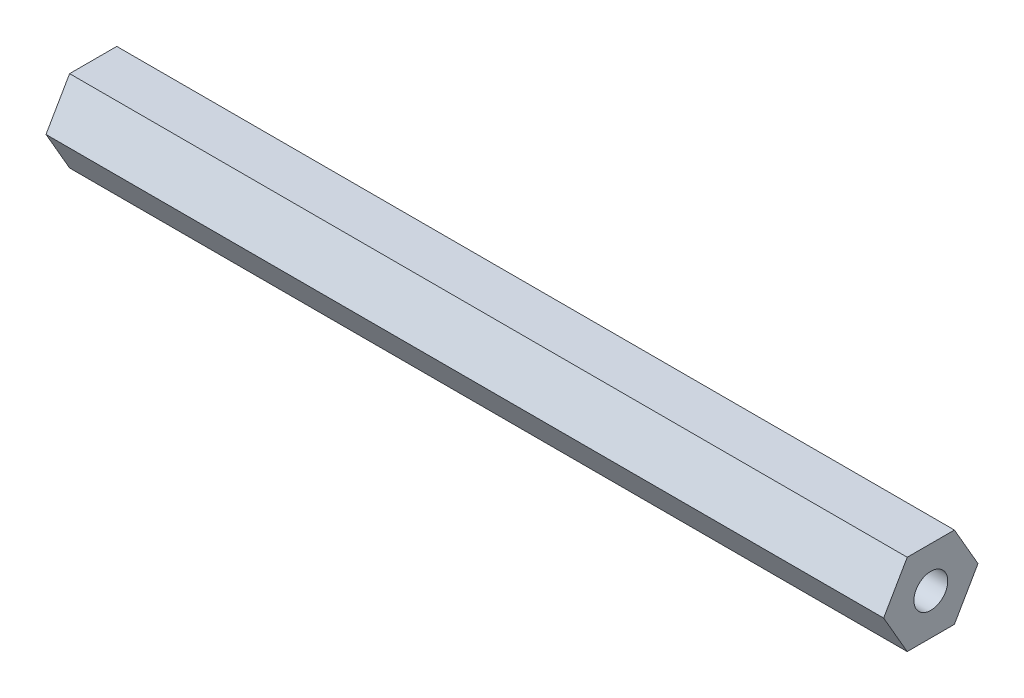
ISO-10303-21;
HEADER;
FILE_DESCRIPTION(('STEP AP214'),'2;1');
FILE_NAME('part.step','',(''),(''),'','','');
FILE_SCHEMA(('AUTOMOTIVE_DESIGN { 1 0 10303 214 1 1 1 1 }'));
ENDSEC;
DATA;
#1=APPLICATION_CONTEXT('core data for automotive mechanical design processes');
#2=APPLICATION_PROTOCOL_DEFINITION('international standard','automotive_design',2000,#1);
#3=PRODUCT_CONTEXT('',#1,'mechanical');
#4=PRODUCT('Part','Part','',(#3));
#5=PRODUCT_RELATED_PRODUCT_CATEGORY('part','',(#4));
#6=PRODUCT_DEFINITION_FORMATION('','',#4);
#7=PRODUCT_DEFINITION_CONTEXT('part definition',#1,'design');
#8=PRODUCT_DEFINITION('design','',#6,#7);
#9=PRODUCT_DEFINITION_SHAPE('','',#8);
#10=(LENGTH_UNIT() NAMED_UNIT(*) SI_UNIT(.MILLI.,.METRE.));
#11=(NAMED_UNIT(*) PLANE_ANGLE_UNIT() SI_UNIT($,.RADIAN.));
#12=(NAMED_UNIT(*) SI_UNIT($,.STERADIAN.) SOLID_ANGLE_UNIT());
#13=UNCERTAINTY_MEASURE_WITH_UNIT(LENGTH_MEASURE(1.E-05),#10,'distance_accuracy_value','');
#14=(GEOMETRIC_REPRESENTATION_CONTEXT(3) GLOBAL_UNCERTAINTY_ASSIGNED_CONTEXT((#13)) GLOBAL_UNIT_ASSIGNED_CONTEXT((#10,
#11,#12)) REPRESENTATION_CONTEXT('',''));
#15=CARTESIAN_POINT('',(0.,0.,0.));
#16=DIRECTION('',(0.,0.,1.));
#17=DIRECTION('',(1.,0.,0.));
#18=AXIS2_PLACEMENT_3D('',#15,#16,#17);
#19=CARTESIAN_POINT('',(130.175,0.,0.));
#20=DIRECTION('',(1.,0.,0.));
#21=DIRECTION('',(0.,0.,-1.));
#22=AXIS2_PLACEMENT_3D('',#19,#20,#21);
#23=PLANE('',#22);
#24=DIRECTION('',(0.,0.866025403784438,0.5));
#25=VECTOR('',#24,1.);
#26=CARTESIAN_POINT('',(130.175,0.,-7.33234841870825));
#27=LINE('',#26,#25);
#28=CARTESIAN_POINT('',(130.175,0.,-7.33234841870825));
#29=VERTEX_POINT('',#28);
#30=CARTESIAN_POINT('',(130.175,6.35,-3.66617420935412));
#31=VERTEX_POINT('',#30);
#32=EDGE_CURVE('E129',#29,#31,#27,.T.);
#33=ORIENTED_EDGE('',*,*,#32,.T.);
#34=DIRECTION('',(0.,0.,1.));
#35=VECTOR('',#34,1.);
#36=CARTESIAN_POINT('',(130.175,6.35,-3.66617420935412));
#37=LINE('',#36,#35);
#38=CARTESIAN_POINT('',(130.175,6.35,3.66617420935412));
#39=VERTEX_POINT('',#38);
#40=EDGE_CURVE('E87',#31,#39,#37,.T.);
#41=ORIENTED_EDGE('',*,*,#40,.T.);
#42=DIRECTION('',(0.,-0.866025403784439,0.5));
#43=VECTOR('',#42,1.);
#44=CARTESIAN_POINT('',(130.175,6.35,3.66617420935412));
#45=LINE('',#44,#43);
#46=CARTESIAN_POINT('',(130.175,0.,7.33234841870825));
#47=VERTEX_POINT('',#46);
#48=EDGE_CURVE('E100',#39,#47,#45,.T.);
#49=ORIENTED_EDGE('',*,*,#48,.T.);
#50=DIRECTION('',(0.,-0.866025403784438,-0.5));
#51=VECTOR('',#50,1.);
#52=CARTESIAN_POINT('',(130.175,0.,7.33234841870825));
#53=LINE('',#52,#51);
#54=CARTESIAN_POINT('',(130.175,-6.35,3.66617420935412));
#55=VERTEX_POINT('',#54);
#56=EDGE_CURVE('E94',#47,#55,#53,.T.);
#57=ORIENTED_EDGE('',*,*,#56,.T.);
#58=DIRECTION('',(0.,0.,-1.));
#59=VECTOR('',#58,1.);
#60=CARTESIAN_POINT('',(130.175,-6.35,3.66617420935412));
#61=LINE('',#60,#59);
#62=CARTESIAN_POINT('',(130.175,-6.35,-3.66617420935413));
#63=VERTEX_POINT('',#62);
#64=EDGE_CURVE('E98',#55,#63,#61,.T.);
#65=ORIENTED_EDGE('',*,*,#64,.T.);
#66=DIRECTION('',(0.,0.866025403784439,-0.5));
#67=VECTOR('',#66,1.);
#68=CARTESIAN_POINT('',(130.175,-6.35,-3.66617420935413));
#69=LINE('',#68,#67);
#70=EDGE_CURVE('E50',#63,#29,#69,.T.);
#71=ORIENTED_EDGE('',*,*,#70,.T.);
#72=EDGE_LOOP('',(#33,#41,#49,#57,#65,#71));
#73=FACE_BOUND('',#72,.T.);
#74=CARTESIAN_POINT('',(130.175,0.,0.));
#75=DIRECTION('',(1.,0.,0.));
#76=DIRECTION('',(0.,0.,-1.));
#77=AXIS2_PLACEMENT_3D('',#74,#75,#76);
#78=CIRCLE('',#77,2.6289);
#79=CARTESIAN_POINT('',(130.175,0.,-2.6289));
#80=VERTEX_POINT('',#79);
#81=EDGE_CURVE('E122',#80,#80,#78,.T.);
#82=ORIENTED_EDGE('',*,*,#81,.F.);
#83=EDGE_LOOP('',(#82));
#84=FACE_BOUND('',#83,.T.);
#85=ADVANCED_FACE('F33',(#73,#84),#23,.T.);
#86=CARTESIAN_POINT('',(0.,0.,0.));
#87=DIRECTION('',(1.,0.,0.));
#88=DIRECTION('',(0.,0.,-1.));
#89=AXIS2_PLACEMENT_3D('',#86,#87,#88);
#90=PLANE('',#89);
#91=DIRECTION('',(0.,0.866025403784438,0.5));
#92=VECTOR('',#91,1.);
#93=CARTESIAN_POINT('',(0.,0.,-7.33234841870825));
#94=LINE('',#93,#92);
#95=CARTESIAN_POINT('',(0.,0.,-7.33234841870825));
#96=VERTEX_POINT('',#95);
#97=CARTESIAN_POINT('',(0.,6.35,-3.66617420935412));
#98=VERTEX_POINT('',#97);
#99=EDGE_CURVE('E118',#96,#98,#94,.T.);
#100=ORIENTED_EDGE('',*,*,#99,.F.);
#101=DIRECTION('',(0.,0.866025403784439,-0.5));
#102=VECTOR('',#101,1.);
#103=CARTESIAN_POINT('',(0.,-6.35,-3.66617420935413));
#104=LINE('',#103,#102);
#105=CARTESIAN_POINT('',(0.,-6.35,-3.66617420935413));
#106=VERTEX_POINT('',#105);
#107=EDGE_CURVE('E79',#106,#96,#104,.T.);
#108=ORIENTED_EDGE('',*,*,#107,.F.);
#109=DIRECTION('',(0.,0.,-1.));
#110=VECTOR('',#109,1.);
#111=CARTESIAN_POINT('',(0.,-6.35,3.66617420935412));
#112=LINE('',#111,#110);
#113=CARTESIAN_POINT('',(0.,-6.35,3.66617420935412));
#114=VERTEX_POINT('',#113);
#115=EDGE_CURVE('E73',#114,#106,#112,.T.);
#116=ORIENTED_EDGE('',*,*,#115,.F.);
#117=DIRECTION('',(0.,-0.866025403784438,-0.5));
#118=VECTOR('',#117,1.);
#119=CARTESIAN_POINT('',(0.,0.,7.33234841870825));
#120=LINE('',#119,#118);
#121=CARTESIAN_POINT('',(0.,0.,7.33234841870825));
#122=VERTEX_POINT('',#121);
#123=EDGE_CURVE('E108',#122,#114,#120,.T.);
#124=ORIENTED_EDGE('',*,*,#123,.F.);
#125=DIRECTION('',(0.,-0.866025403784439,0.5));
#126=VECTOR('',#125,1.);
#127=CARTESIAN_POINT('',(0.,6.35,3.66617420935412));
#128=LINE('',#127,#126);
#129=CARTESIAN_POINT('',(0.,6.35,3.66617420935412));
#130=VERTEX_POINT('',#129);
#131=EDGE_CURVE('E124',#130,#122,#128,.T.);
#132=ORIENTED_EDGE('',*,*,#131,.F.);
#133=DIRECTION('',(0.,0.,1.));
#134=VECTOR('',#133,1.);
#135=CARTESIAN_POINT('',(0.,6.35,-3.66617420935412));
#136=LINE('',#135,#134);
#137=EDGE_CURVE('E121',#98,#130,#136,.T.);
#138=ORIENTED_EDGE('',*,*,#137,.F.);
#139=EDGE_LOOP('',(#100,#108,#116,#124,#132,#138));
#140=FACE_BOUND('',#139,.T.);
#141=CARTESIAN_POINT('',(0.,0.,0.));
#142=DIRECTION('',(1.,0.,0.));
#143=DIRECTION('',(0.,0.,-1.));
#144=AXIS2_PLACEMENT_3D('',#141,#142,#143);
#145=CIRCLE('',#144,2.6289);
#146=CARTESIAN_POINT('',(0.,0.,-2.6289));
#147=VERTEX_POINT('',#146);
#148=EDGE_CURVE('E222',#147,#147,#145,.T.);
#149=ORIENTED_EDGE('',*,*,#148,.T.);
#150=EDGE_LOOP('',(#149));
#151=FACE_BOUND('',#150,.T.);
#152=ADVANCED_FACE('F138',(#140,#151),#90,.F.);
#153=CARTESIAN_POINT('',(130.175,0.,-7.33234841870825));
#154=DIRECTION('',(0.,-0.5,0.866025403784438));
#155=DIRECTION('',(0.,-0.866025403784438,-0.5));
#156=AXIS2_PLACEMENT_3D('',#153,#154,#155);
#157=PLANE('',#156);
#158=ORIENTED_EDGE('',*,*,#99,.T.);
#159=DIRECTION('',(-1.,0.,0.));
#160=VECTOR('',#159,1.);
#161=CARTESIAN_POINT('',(130.175,6.35,-3.66617420935412));
#162=LINE('',#161,#160);
#163=EDGE_CURVE('E11',#31,#98,#162,.T.);
#164=ORIENTED_EDGE('',*,*,#163,.F.);
#165=ORIENTED_EDGE('',*,*,#32,.F.);
#166=DIRECTION('',(-1.,0.,0.));
#167=VECTOR('',#166,1.);
#168=CARTESIAN_POINT('',(130.175,0.,-7.33234841870825));
#169=LINE('',#168,#167);
#170=EDGE_CURVE('E114',#29,#96,#169,.T.);
#171=ORIENTED_EDGE('',*,*,#170,.T.);
#172=EDGE_LOOP('',(#158,#164,#165,#171));
#173=FACE_BOUND('',#172,.T.);
#174=ADVANCED_FACE('F35',(#173),#157,.F.);
#175=CARTESIAN_POINT('',(130.175,6.35,-3.66617420935412));
#176=DIRECTION('',(0.,-1.,0.));
#177=DIRECTION('',(0.,0.,-1.));
#178=AXIS2_PLACEMENT_3D('',#175,#176,#177);
#179=PLANE('',#178);
#180=ORIENTED_EDGE('',*,*,#137,.T.);
#181=DIRECTION('',(-1.,0.,0.));
#182=VECTOR('',#181,1.);
#183=CARTESIAN_POINT('',(130.175,6.35,3.66617420935412));
#184=LINE('',#183,#182);
#185=EDGE_CURVE('E42',#39,#130,#184,.T.);
#186=ORIENTED_EDGE('',*,*,#185,.F.);
#187=ORIENTED_EDGE('',*,*,#40,.F.);
#188=ORIENTED_EDGE('',*,*,#163,.T.);
#189=EDGE_LOOP('',(#180,#186,#187,#188));
#190=FACE_BOUND('',#189,.T.);
#191=ADVANCED_FACE('F163',(#190),#179,.F.);
#192=CARTESIAN_POINT('',(130.175,6.35,3.66617420935412));
#193=DIRECTION('',(0.,-0.5,-0.866025403784439));
#194=DIRECTION('',(0.,0.866025403784439,-0.5));
#195=AXIS2_PLACEMENT_3D('',#192,#193,#194);
#196=PLANE('',#195);
#197=ORIENTED_EDGE('',*,*,#131,.T.);
#198=DIRECTION('',(-1.,0.,0.));
#199=VECTOR('',#198,1.);
#200=CARTESIAN_POINT('',(130.175,0.,7.33234841870825));
#201=LINE('',#200,#199);
#202=EDGE_CURVE('E109',#47,#122,#201,.T.);
#203=ORIENTED_EDGE('',*,*,#202,.F.);
#204=ORIENTED_EDGE('',*,*,#48,.F.);
#205=ORIENTED_EDGE('',*,*,#185,.T.);
#206=EDGE_LOOP('',(#197,#203,#204,#205));
#207=FACE_BOUND('',#206,.T.);
#208=ADVANCED_FACE('F135',(#207),#196,.F.);
#209=CARTESIAN_POINT('',(130.175,0.,7.33234841870825));
#210=DIRECTION('',(0.,0.5,-0.866025403784438));
#211=DIRECTION('',(0.,0.866025403784439,0.5));
#212=AXIS2_PLACEMENT_3D('',#209,#210,#211);
#213=PLANE('',#212);
#214=ORIENTED_EDGE('',*,*,#123,.T.);
#215=DIRECTION('',(-1.,0.,0.));
#216=VECTOR('',#215,1.);
#217=CARTESIAN_POINT('',(130.175,-6.35,3.66617420935412));
#218=LINE('',#217,#216);
#219=EDGE_CURVE('E105',#55,#114,#218,.T.);
#220=ORIENTED_EDGE('',*,*,#219,.F.);
#221=ORIENTED_EDGE('',*,*,#56,.F.);
#222=ORIENTED_EDGE('',*,*,#202,.T.);
#223=EDGE_LOOP('',(#214,#220,#221,#222));
#224=FACE_BOUND('',#223,.T.);
#225=ADVANCED_FACE('F106',(#224),#213,.F.);
#226=CARTESIAN_POINT('',(130.175,-6.35,3.66617420935412));
#227=DIRECTION('',(0.,1.,0.));
#228=DIRECTION('',(0.,0.,1.));
#229=AXIS2_PLACEMENT_3D('',#226,#227,#228);
#230=PLANE('',#229);
#231=ORIENTED_EDGE('',*,*,#115,.T.);
#232=DIRECTION('',(-1.,0.,0.));
#233=VECTOR('',#232,1.);
#234=CARTESIAN_POINT('',(130.175,-6.35,-3.66617420935413));
#235=LINE('',#234,#233);
#236=EDGE_CURVE('E110',#63,#106,#235,.T.);
#237=ORIENTED_EDGE('',*,*,#236,.F.);
#238=ORIENTED_EDGE('',*,*,#64,.F.);
#239=ORIENTED_EDGE('',*,*,#219,.T.);
#240=EDGE_LOOP('',(#231,#237,#238,#239));
#241=FACE_BOUND('',#240,.T.);
#242=ADVANCED_FACE('F112',(#241),#230,.F.);
#243=CARTESIAN_POINT('',(130.175,-6.35,-3.66617420935413));
#244=DIRECTION('',(0.,0.5,0.866025403784439));
#245=DIRECTION('',(0.,-0.866025403784439,0.5));
#246=AXIS2_PLACEMENT_3D('',#243,#244,#245);
#247=PLANE('',#246);
#248=ORIENTED_EDGE('',*,*,#107,.T.);
#249=ORIENTED_EDGE('',*,*,#170,.F.);
#250=ORIENTED_EDGE('',*,*,#70,.F.);
#251=ORIENTED_EDGE('',*,*,#236,.T.);
#252=EDGE_LOOP('',(#248,#249,#250,#251));
#253=FACE_BOUND('',#252,.T.);
#254=ADVANCED_FACE('F143',(#253),#247,.F.);
#255=CARTESIAN_POINT('',(130.175,0.,0.));
#256=DIRECTION('',(-1.,0.,0.));
#257=DIRECTION('',(0.,0.,1.));
#258=AXIS2_PLACEMENT_3D('',#255,#256,#257);
#259=CYLINDRICAL_SURFACE('',#258,2.6289);
#260=ORIENTED_EDGE('',*,*,#81,.T.);
#261=EDGE_LOOP('',(#260));
#262=FACE_BOUND('',#261,.T.);
#263=ORIENTED_EDGE('',*,*,#148,.F.);
#264=EDGE_LOOP('',(#263));
#265=FACE_BOUND('',#264,.T.);
#266=ADVANCED_FACE('F145',(#262,#265),#259,.F.);
#267=CLOSED_SHELL('',(#85,#152,#174,#191,#208,#225,#242,#254,#266));
#268=MANIFOLD_SOLID_BREP('B2',#267);
#269=ADVANCED_BREP_SHAPE_REPRESENTATION('',(#18,#268),#14);
#270=SHAPE_DEFINITION_REPRESENTATION(#9,#269);
ENDSEC;
END-ISO-10303-21;
